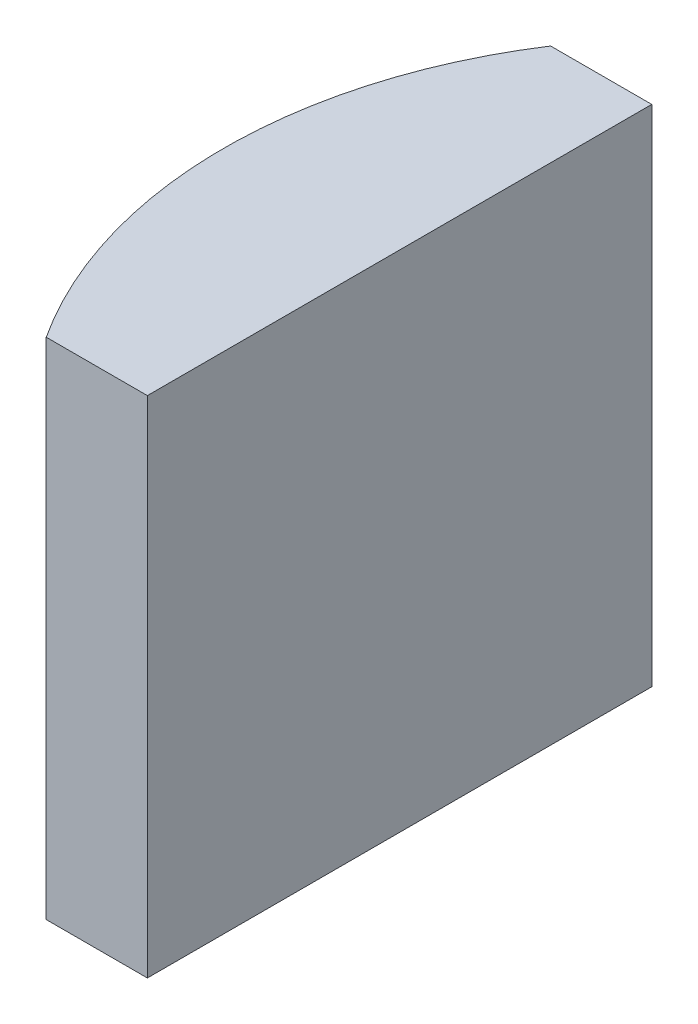
ISO-10303-21;
HEADER;
FILE_DESCRIPTION(('STEP AP214'),'2;1');
FILE_NAME('part.step','',(''),(''),'','','');
FILE_SCHEMA(('AUTOMOTIVE_DESIGN { 1 0 10303 214 1 1 1 1 }'));
ENDSEC;
DATA;
#1=APPLICATION_CONTEXT('core data for automotive mechanical design processes');
#2=APPLICATION_PROTOCOL_DEFINITION('international standard','automotive_design',2000,#1);
#3=PRODUCT_CONTEXT('',#1,'mechanical');
#4=PRODUCT('Part','Part','',(#3));
#5=PRODUCT_RELATED_PRODUCT_CATEGORY('part','',(#4));
#6=PRODUCT_DEFINITION_FORMATION('','',#4);
#7=PRODUCT_DEFINITION_CONTEXT('part definition',#1,'design');
#8=PRODUCT_DEFINITION('design','',#6,#7);
#9=PRODUCT_DEFINITION_SHAPE('','',#8);
#10=(LENGTH_UNIT() NAMED_UNIT(*) SI_UNIT(.MILLI.,.METRE.));
#11=(NAMED_UNIT(*) PLANE_ANGLE_UNIT() SI_UNIT($,.RADIAN.));
#12=(NAMED_UNIT(*) SI_UNIT($,.STERADIAN.) SOLID_ANGLE_UNIT());
#13=UNCERTAINTY_MEASURE_WITH_UNIT(LENGTH_MEASURE(1.E-05),#10,'distance_accuracy_value','');
#14=(GEOMETRIC_REPRESENTATION_CONTEXT(3) GLOBAL_UNCERTAINTY_ASSIGNED_CONTEXT((#13)) GLOBAL_UNIT_ASSIGNED_CONTEXT((#10,
#11,#12)) REPRESENTATION_CONTEXT('',''));
#15=CARTESIAN_POINT('',(0.,0.,0.));
#16=DIRECTION('',(0.,0.,1.));
#17=DIRECTION('',(1.,0.,0.));
#18=AXIS2_PLACEMENT_3D('',#15,#16,#17);
#19=CARTESIAN_POINT('',(4.35520433485127,10.,0.));
#20=DIRECTION('',(0.,-1.,0.));
#21=DIRECTION('',(0.,0.,-1.));
#22=AXIS2_PLACEMENT_3D('',#19,#20,#21);
#23=CYLINDRICAL_SURFACE('',#22,9.16);
#24=CARTESIAN_POINT('',(4.35520433485127,0.,0.));
#25=DIRECTION('',(0.,1.,0.));
#26=DIRECTION('',(0.,0.,1.));
#27=AXIS2_PLACEMENT_3D('',#24,#25,#26);
#28=CIRCLE('',#27,9.16);
#29=CARTESIAN_POINT('',(-3.31979403648407,0.,-5.));
#30=VERTEX_POINT('',#29);
#31=CARTESIAN_POINT('',(-3.31979403648407,0.,5.));
#32=VERTEX_POINT('',#31);
#33=EDGE_CURVE('E100',#30,#32,#28,.T.);
#34=ORIENTED_EDGE('',*,*,#33,.T.);
#35=DIRECTION('',(0.,-1.,0.));
#36=VECTOR('',#35,1.);
#37=CARTESIAN_POINT('',(-3.31979403648407,10.,5.));
#38=LINE('',#37,#36);
#39=CARTESIAN_POINT('',(-3.31979403648407,10.,5.));
#40=VERTEX_POINT('',#39);
#41=EDGE_CURVE('E11',#40,#32,#38,.T.);
#42=ORIENTED_EDGE('',*,*,#41,.F.);
#43=CARTESIAN_POINT('',(4.35520433485127,10.,0.));
#44=DIRECTION('',(0.,1.,0.));
#45=DIRECTION('',(0.,0.,1.));
#46=AXIS2_PLACEMENT_3D('',#43,#44,#45);
#47=CIRCLE('',#46,9.16);
#48=CARTESIAN_POINT('',(-3.31979403648407,10.,-5.));
#49=VERTEX_POINT('',#48);
#50=EDGE_CURVE('E88',#49,#40,#47,.T.);
#51=ORIENTED_EDGE('',*,*,#50,.F.);
#52=DIRECTION('',(0.,-1.,0.));
#53=VECTOR('',#52,1.);
#54=CARTESIAN_POINT('',(-3.31979403648407,10.,-5.));
#55=LINE('',#54,#53);
#56=EDGE_CURVE('E96',#49,#30,#55,.T.);
#57=ORIENTED_EDGE('',*,*,#56,.T.);
#58=EDGE_LOOP('',(#34,#42,#51,#57));
#59=FACE_BOUND('',#58,.T.);
#60=ADVANCED_FACE('F37',(#59),#23,.T.);
#61=CARTESIAN_POINT('',(-3.31979403648407,10.,5.));
#62=DIRECTION('',(0.,0.,-1.));
#63=DIRECTION('',(-1.,0.,0.));
#64=AXIS2_PLACEMENT_3D('',#61,#62,#63);
#65=PLANE('',#64);
#66=DIRECTION('',(1.,0.,0.));
#67=VECTOR('',#66,1.);
#68=CARTESIAN_POINT('',(-3.31979403648407,0.,5.));
#69=LINE('',#68,#67);
#70=CARTESIAN_POINT('',(-1.31479566514873,0.,5.));
#71=VERTEX_POINT('',#70);
#72=EDGE_CURVE('E92',#32,#71,#69,.T.);
#73=ORIENTED_EDGE('',*,*,#72,.T.);
#74=DIRECTION('',(0.,-1.,0.));
#75=VECTOR('',#74,1.);
#76=CARTESIAN_POINT('',(-1.31479566514873,10.,5.));
#77=LINE('',#76,#75);
#78=CARTESIAN_POINT('',(-1.31479566514873,10.,5.));
#79=VERTEX_POINT('',#78);
#80=EDGE_CURVE('E45',#79,#71,#77,.T.);
#81=ORIENTED_EDGE('',*,*,#80,.F.);
#82=DIRECTION('',(1.,0.,0.));
#83=VECTOR('',#82,1.);
#84=CARTESIAN_POINT('',(-3.31979403648407,10.,5.));
#85=LINE('',#84,#83);
#86=EDGE_CURVE('E83',#40,#79,#85,.T.);
#87=ORIENTED_EDGE('',*,*,#86,.F.);
#88=ORIENTED_EDGE('',*,*,#41,.T.);
#89=EDGE_LOOP('',(#73,#81,#87,#88));
#90=FACE_BOUND('',#89,.T.);
#91=ADVANCED_FACE('F91',(#90),#65,.F.);
#92=CARTESIAN_POINT('',(-1.31479566514874,10.,-5.));
#93=DIRECTION('',(-1.,0.,0.));
#94=DIRECTION('',(0.,0.,1.));
#95=AXIS2_PLACEMENT_3D('',#92,#93,#94);
#96=PLANE('',#95);
#97=DIRECTION('',(0.,0.,-1.));
#98=VECTOR('',#97,1.);
#99=CARTESIAN_POINT('',(-1.31479566514874,0.,-5.));
#100=LINE('',#99,#98);
#101=CARTESIAN_POINT('',(-1.31479566514874,0.,-5.));
#102=VERTEX_POINT('',#101);
#103=EDGE_CURVE('E70',#71,#102,#100,.T.);
#104=ORIENTED_EDGE('',*,*,#103,.T.);
#105=DIRECTION('',(0.,-1.,0.));
#106=VECTOR('',#105,1.);
#107=CARTESIAN_POINT('',(-1.31479566514874,10.,-5.));
#108=LINE('',#107,#106);
#109=CARTESIAN_POINT('',(-1.31479566514874,10.,-5.));
#110=VERTEX_POINT('',#109);
#111=EDGE_CURVE('E93',#110,#102,#108,.T.);
#112=ORIENTED_EDGE('',*,*,#111,.F.);
#113=DIRECTION('',(0.,0.,-1.));
#114=VECTOR('',#113,1.);
#115=CARTESIAN_POINT('',(-1.31479566514874,10.,-5.));
#116=LINE('',#115,#114);
#117=EDGE_CURVE('E86',#79,#110,#116,.T.);
#118=ORIENTED_EDGE('',*,*,#117,.F.);
#119=ORIENTED_EDGE('',*,*,#80,.T.);
#120=EDGE_LOOP('',(#104,#112,#118,#119));
#121=FACE_BOUND('',#120,.T.);
#122=ADVANCED_FACE('F94',(#121),#96,.F.);
#123=CARTESIAN_POINT('',(-3.31979403648407,10.,-5.));
#124=DIRECTION('',(0.,0.,1.));
#125=DIRECTION('',(1.,0.,0.));
#126=AXIS2_PLACEMENT_3D('',#123,#124,#125);
#127=PLANE('',#126);
#128=DIRECTION('',(-1.,0.,0.));
#129=VECTOR('',#128,1.);
#130=CARTESIAN_POINT('',(-3.31979403648407,0.,-5.));
#131=LINE('',#130,#129);
#132=EDGE_CURVE('E76',#102,#30,#131,.T.);
#133=ORIENTED_EDGE('',*,*,#132,.T.);
#134=ORIENTED_EDGE('',*,*,#56,.F.);
#135=DIRECTION('',(-1.,0.,0.));
#136=VECTOR('',#135,1.);
#137=CARTESIAN_POINT('',(-3.31979403648407,10.,-5.));
#138=LINE('',#137,#136);
#139=EDGE_CURVE('E53',#110,#49,#138,.T.);
#140=ORIENTED_EDGE('',*,*,#139,.F.);
#141=ORIENTED_EDGE('',*,*,#111,.T.);
#142=EDGE_LOOP('',(#133,#134,#140,#141));
#143=FACE_BOUND('',#142,.T.);
#144=ADVANCED_FACE('F107',(#143),#127,.F.);
#145=CARTESIAN_POINT('',(4.35520433485127,10.,0.));
#146=DIRECTION('',(0.,1.,0.));
#147=DIRECTION('',(0.,0.,1.));
#148=AXIS2_PLACEMENT_3D('',#145,#146,#147);
#149=PLANE('',#148);
#150=ORIENTED_EDGE('',*,*,#50,.T.);
#151=ORIENTED_EDGE('',*,*,#86,.T.);
#152=ORIENTED_EDGE('',*,*,#117,.T.);
#153=ORIENTED_EDGE('',*,*,#139,.T.);
#154=EDGE_LOOP('',(#150,#151,#152,#153));
#155=FACE_BOUND('',#154,.T.);
#156=ADVANCED_FACE('F84',(#155),#149,.T.);
#157=CARTESIAN_POINT('',(4.35520433485127,0.,0.));
#158=DIRECTION('',(0.,1.,0.));
#159=DIRECTION('',(0.,0.,1.));
#160=AXIS2_PLACEMENT_3D('',#157,#158,#159);
#161=PLANE('',#160);
#162=ORIENTED_EDGE('',*,*,#33,.F.);
#163=ORIENTED_EDGE('',*,*,#132,.F.);
#164=ORIENTED_EDGE('',*,*,#103,.F.);
#165=ORIENTED_EDGE('',*,*,#72,.F.);
#166=EDGE_LOOP('',(#162,#163,#164,#165));
#167=FACE_BOUND('',#166,.T.);
#168=ADVANCED_FACE('F110',(#167),#161,.F.);
#169=CLOSED_SHELL('',(#60,#91,#122,#144,#156,#168));
#170=MANIFOLD_SOLID_BREP('B2',#169);
#171=ADVANCED_BREP_SHAPE_REPRESENTATION('',(#18,#170),#14);
#172=SHAPE_DEFINITION_REPRESENTATION(#9,#171);
ENDSEC;
END-ISO-10303-21;
